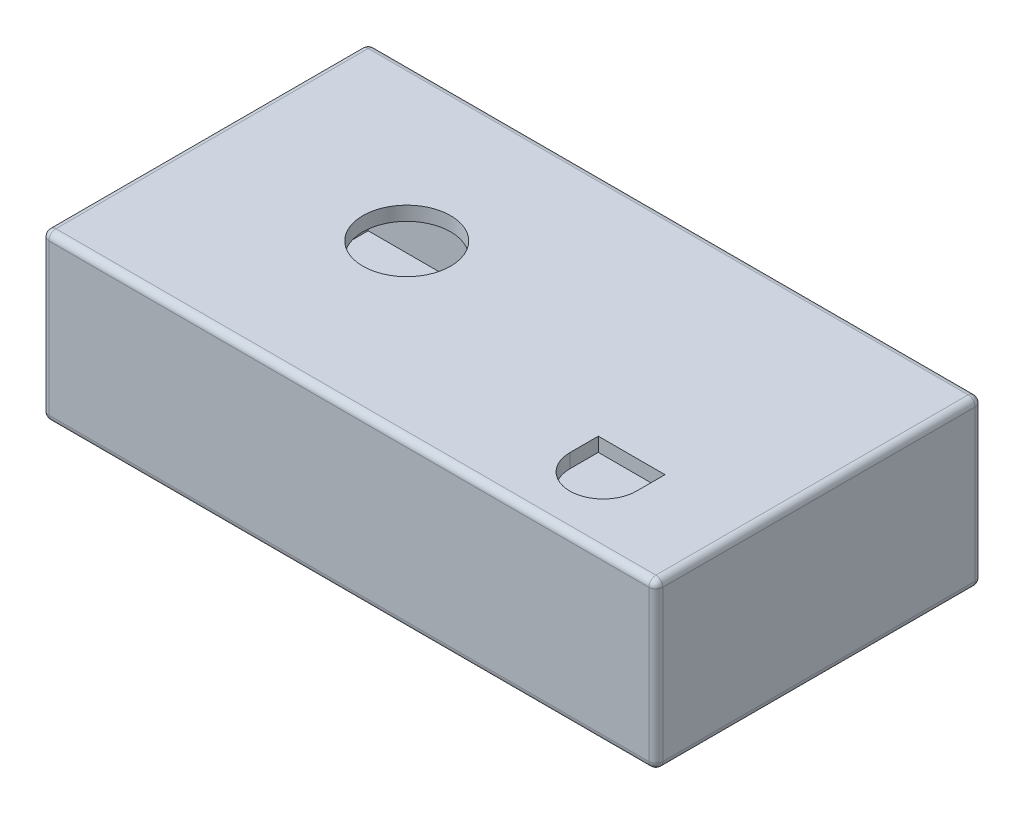
ISO-10303-21;
HEADER;
FILE_DESCRIPTION(('STEP AP214'),'2;1');
FILE_NAME('part.step','',(''),(''),'','','');
FILE_SCHEMA(('AUTOMOTIVE_DESIGN { 1 0 10303 214 1 1 1 1 }'));
ENDSEC;
DATA;
#1=APPLICATION_CONTEXT('core data for automotive mechanical design processes');
#2=APPLICATION_PROTOCOL_DEFINITION('international standard','automotive_design',2000,#1);
#3=PRODUCT_CONTEXT('',#1,'mechanical');
#4=PRODUCT('Part','Part','',(#3));
#5=PRODUCT_RELATED_PRODUCT_CATEGORY('part','',(#4));
#6=PRODUCT_DEFINITION_FORMATION('','',#4);
#7=PRODUCT_DEFINITION_CONTEXT('part definition',#1,'design');
#8=PRODUCT_DEFINITION('design','',#6,#7);
#9=PRODUCT_DEFINITION_SHAPE('','',#8);
#10=(LENGTH_UNIT() NAMED_UNIT(*) SI_UNIT(.MILLI.,.METRE.));
#11=(NAMED_UNIT(*) PLANE_ANGLE_UNIT() SI_UNIT($,.RADIAN.));
#12=(NAMED_UNIT(*) SI_UNIT($,.STERADIAN.) SOLID_ANGLE_UNIT());
#13=UNCERTAINTY_MEASURE_WITH_UNIT(LENGTH_MEASURE(1.E-05),#10,'distance_accuracy_value','');
#14=(GEOMETRIC_REPRESENTATION_CONTEXT(3) GLOBAL_UNCERTAINTY_ASSIGNED_CONTEXT((#13)) GLOBAL_UNIT_ASSIGNED_CONTEXT((#10,
#11,#12)) REPRESENTATION_CONTEXT('',''));
#15=CARTESIAN_POINT('',(0.,0.,0.));
#16=DIRECTION('',(0.,0.,1.));
#17=DIRECTION('',(1.,0.,0.));
#18=AXIS2_PLACEMENT_3D('',#15,#16,#17);
#19=CARTESIAN_POINT('',(0.,0.,118.11));
#20=DIRECTION('',(1.,0.,0.));
#21=DIRECTION('',(0.,0.,-1.));
#22=AXIS2_PLACEMENT_3D('',#19,#20,#21);
#23=PLANE('',#22);
#24=DIRECTION('',(0.,-1.,0.));
#25=VECTOR('',#24,1.);
#26=CARTESIAN_POINT('',(0.,0.,2.54));
#27=LINE('',#26,#25);
#28=CARTESIAN_POINT('',(0.,57.15,2.54));
#29=VERTEX_POINT('',#28);
#30=CARTESIAN_POINT('',(0.,2.54,2.54));
#31=VERTEX_POINT('',#30);
#32=EDGE_CURVE('E232',#29,#31,#27,.T.);
#33=ORIENTED_EDGE('',*,*,#32,.T.);
#34=DIRECTION('',(0.,0.,-1.));
#35=VECTOR('',#34,1.);
#36=CARTESIAN_POINT('',(0.,2.54,118.11));
#37=LINE('',#36,#35);
#38=CARTESIAN_POINT('',(0.,2.54,115.57));
#39=VERTEX_POINT('',#38);
#40=EDGE_CURVE('E234',#31,#39,#37,.F.);
#41=ORIENTED_EDGE('',*,*,#40,.T.);
#42=DIRECTION('',(0.,-1.,0.));
#43=VECTOR('',#42,1.);
#44=CARTESIAN_POINT('',(0.,0.,115.57));
#45=LINE('',#44,#43);
#46=CARTESIAN_POINT('',(0.,57.15,115.57));
#47=VERTEX_POINT('',#46);
#48=EDGE_CURVE('E230',#39,#47,#45,.F.);
#49=ORIENTED_EDGE('',*,*,#48,.T.);
#50=DIRECTION('',(0.,0.,-1.));
#51=VECTOR('',#50,1.);
#52=CARTESIAN_POINT('',(0.,57.15,118.11));
#53=LINE('',#52,#51);
#54=EDGE_CURVE('E228',#47,#29,#53,.T.);
#55=ORIENTED_EDGE('',*,*,#54,.T.);
#56=EDGE_LOOP('',(#33,#41,#49,#55));
#57=FACE_BOUND('',#56,.T.);
#58=ADVANCED_FACE('F32',(#57),#23,.F.);
#59=CARTESIAN_POINT('',(0.,0.,118.11));
#60=DIRECTION('',(0.,1.,0.));
#61=DIRECTION('',(0.,0.,1.));
#62=AXIS2_PLACEMENT_3D('',#59,#60,#61);
#63=PLANE('',#62);
#64=DIRECTION('',(0.,0.,-1.));
#65=VECTOR('',#64,1.);
#66=CARTESIAN_POINT('',(219.71,0.,118.11));
#67=LINE('',#66,#65);
#68=CARTESIAN_POINT('',(219.71,0.,2.54));
#69=VERTEX_POINT('',#68);
#70=CARTESIAN_POINT('',(219.71,0.,115.57));
#71=VERTEX_POINT('',#70);
#72=EDGE_CURVE('E214',#69,#71,#67,.F.);
#73=ORIENTED_EDGE('',*,*,#72,.T.);
#74=DIRECTION('',(1.,0.,0.));
#75=VECTOR('',#74,1.);
#76=CARTESIAN_POINT('',(0.,0.,115.57));
#77=LINE('',#76,#75);
#78=CARTESIAN_POINT('',(2.54,0.,115.57));
#79=VERTEX_POINT('',#78);
#80=EDGE_CURVE('E216',#71,#79,#77,.F.);
#81=ORIENTED_EDGE('',*,*,#80,.T.);
#82=DIRECTION('',(0.,0.,-1.));
#83=VECTOR('',#82,1.);
#84=CARTESIAN_POINT('',(2.54,0.,118.11));
#85=LINE('',#84,#83);
#86=CARTESIAN_POINT('',(2.54,0.,2.54));
#87=VERTEX_POINT('',#86);
#88=EDGE_CURVE('E212',#79,#87,#85,.T.);
#89=ORIENTED_EDGE('',*,*,#88,.T.);
#90=DIRECTION('',(1.,0.,0.));
#91=VECTOR('',#90,1.);
#92=CARTESIAN_POINT('',(222.25,0.,2.54));
#93=LINE('',#92,#91);
#94=EDGE_CURVE('E210',#87,#69,#93,.T.);
#95=ORIENTED_EDGE('',*,*,#94,.T.);
#96=EDGE_LOOP('',(#73,#81,#89,#95));
#97=FACE_BOUND('',#96,.T.);
#98=ADVANCED_FACE('F380',(#97),#63,.F.);
#99=CARTESIAN_POINT('',(222.25,0.,118.11));
#100=DIRECTION('',(-1.,0.,0.));
#101=DIRECTION('',(0.,0.,1.));
#102=AXIS2_PLACEMENT_3D('',#99,#100,#101);
#103=PLANE('',#102);
#104=DIRECTION('',(0.,1.,0.));
#105=VECTOR('',#104,1.);
#106=CARTESIAN_POINT('',(222.25,0.,115.57));
#107=LINE('',#106,#105);
#108=CARTESIAN_POINT('',(222.25,57.15,115.57));
#109=VERTEX_POINT('',#108);
#110=CARTESIAN_POINT('',(222.25,2.54,115.57));
#111=VERTEX_POINT('',#110);
#112=EDGE_CURVE('E221',#109,#111,#107,.F.);
#113=ORIENTED_EDGE('',*,*,#112,.T.);
#114=DIRECTION('',(0.,0.,-1.));
#115=VECTOR('',#114,1.);
#116=CARTESIAN_POINT('',(222.25,2.54,118.11));
#117=LINE('',#116,#115);
#118=CARTESIAN_POINT('',(222.25,2.54,2.54));
#119=VERTEX_POINT('',#118);
#120=EDGE_CURVE('E225',#111,#119,#117,.T.);
#121=ORIENTED_EDGE('',*,*,#120,.T.);
#122=DIRECTION('',(0.,1.,0.));
#123=VECTOR('',#122,1.);
#124=CARTESIAN_POINT('',(222.25,59.69,2.54));
#125=LINE('',#124,#123);
#126=CARTESIAN_POINT('',(222.25,57.15,2.54));
#127=VERTEX_POINT('',#126);
#128=EDGE_CURVE('E223',#119,#127,#125,.T.);
#129=ORIENTED_EDGE('',*,*,#128,.T.);
#130=DIRECTION('',(0.,0.,-1.));
#131=VECTOR('',#130,1.);
#132=CARTESIAN_POINT('',(222.25,57.15,118.11));
#133=LINE('',#132,#131);
#134=EDGE_CURVE('E219',#127,#109,#133,.F.);
#135=ORIENTED_EDGE('',*,*,#134,.T.);
#136=EDGE_LOOP('',(#113,#121,#129,#135));
#137=FACE_BOUND('',#136,.T.);
#138=ADVANCED_FACE('F386',(#137),#103,.F.);
#139=CARTESIAN_POINT('',(0.,59.69,118.11));
#140=DIRECTION('',(0.,-1.,0.));
#141=DIRECTION('',(0.,0.,-1.));
#142=AXIS2_PLACEMENT_3D('',#139,#140,#141);
#143=PLANE('',#142);
#144=CARTESIAN_POINT('',(177.8,59.69,92.71));
#145=DIRECTION('',(0.,1.,0.));
#146=DIRECTION('',(0.,0.,-1.));
#147=AXIS2_PLACEMENT_3D('',#144,#145,#146);
#148=CIRCLE('',#147,12.065);
#149=CARTESIAN_POINT('',(165.735,59.69,92.71));
#150=VERTEX_POINT('',#149);
#151=CARTESIAN_POINT('',(189.865,59.69,92.71));
#152=VERTEX_POINT('',#151);
#153=EDGE_CURVE('E180',#150,#152,#148,.T.);
#154=ORIENTED_EDGE('',*,*,#153,.F.);
#155=DIRECTION('',(0.,0.,1.));
#156=VECTOR('',#155,1.);
#157=CARTESIAN_POINT('',(165.735,59.69,92.71));
#158=LINE('',#157,#156);
#159=CARTESIAN_POINT('',(165.735,59.69,82.423));
#160=VERTEX_POINT('',#159);
#161=EDGE_CURVE('E47',#160,#150,#158,.T.);
#162=ORIENTED_EDGE('',*,*,#161,.F.);
#163=DIRECTION('',(-1.,0.,0.));
#164=VECTOR('',#163,1.);
#165=CARTESIAN_POINT('',(165.735,59.69,82.423));
#166=LINE('',#165,#164);
#167=CARTESIAN_POINT('',(189.865,59.69,82.423));
#168=VERTEX_POINT('',#167);
#169=EDGE_CURVE('E187',#168,#160,#166,.T.);
#170=ORIENTED_EDGE('',*,*,#169,.F.);
#171=DIRECTION('',(0.,0.,-1.));
#172=VECTOR('',#171,1.);
#173=CARTESIAN_POINT('',(189.865,59.69,82.423));
#174=LINE('',#173,#172);
#175=EDGE_CURVE('E171',#152,#168,#174,.T.);
#176=ORIENTED_EDGE('',*,*,#175,.F.);
#177=EDGE_LOOP('',(#154,#162,#170,#176));
#178=FACE_BOUND('',#177,.T.);
#179=CARTESIAN_POINT('',(69.85,59.69,55.88));
#180=DIRECTION('',(0.,1.,0.));
#181=DIRECTION('',(0.,0.,1.));
#182=AXIS2_PLACEMENT_3D('',#179,#180,#181);
#183=CIRCLE('',#182,15.875);
#184=CARTESIAN_POINT('',(69.85,59.69,71.755));
#185=VERTEX_POINT('',#184);
#186=EDGE_CURVE('E194',#185,#185,#183,.T.);
#187=ORIENTED_EDGE('',*,*,#186,.F.);
#188=EDGE_LOOP('',(#187));
#189=FACE_BOUND('',#188,.T.);
#190=DIRECTION('',(0.,0.,-1.));
#191=VECTOR('',#190,1.);
#192=CARTESIAN_POINT('',(2.54,59.69,118.11));
#193=LINE('',#192,#191);
#194=CARTESIAN_POINT('',(2.54,59.69,2.54));
#195=VERTEX_POINT('',#194);
#196=CARTESIAN_POINT('',(2.54,59.69,115.57));
#197=VERTEX_POINT('',#196);
#198=EDGE_CURVE('E246',#195,#197,#193,.F.);
#199=ORIENTED_EDGE('',*,*,#198,.T.);
#200=DIRECTION('',(-1.,0.,0.));
#201=VECTOR('',#200,1.);
#202=CARTESIAN_POINT('',(0.,59.69,115.57));
#203=LINE('',#202,#201);
#204=CARTESIAN_POINT('',(219.71,59.69,115.57));
#205=VERTEX_POINT('',#204);
#206=EDGE_CURVE('E252',#197,#205,#203,.F.);
#207=ORIENTED_EDGE('',*,*,#206,.T.);
#208=DIRECTION('',(0.,0.,-1.));
#209=VECTOR('',#208,1.);
#210=CARTESIAN_POINT('',(219.71,59.69,118.11));
#211=LINE('',#210,#209);
#212=CARTESIAN_POINT('',(219.71,59.69,2.54));
#213=VERTEX_POINT('',#212);
#214=EDGE_CURVE('E250',#205,#213,#211,.T.);
#215=ORIENTED_EDGE('',*,*,#214,.T.);
#216=DIRECTION('',(-1.,0.,0.));
#217=VECTOR('',#216,1.);
#218=CARTESIAN_POINT('',(0.,59.69,2.54));
#219=LINE('',#218,#217);
#220=EDGE_CURVE('E248',#213,#195,#219,.T.);
#221=ORIENTED_EDGE('',*,*,#220,.T.);
#222=EDGE_LOOP('',(#199,#207,#215,#221));
#223=FACE_BOUND('',#222,.T.);
#224=ADVANCED_FACE('F184',(#178,#189,#223),#143,.F.);
#225=CARTESIAN_POINT('',(0.,0.,118.11));
#226=DIRECTION('',(0.,0.,-1.));
#227=DIRECTION('',(-1.,0.,0.));
#228=AXIS2_PLACEMENT_3D('',#225,#226,#227);
#229=PLANE('',#228);
#230=DIRECTION('',(0.,-1.,0.));
#231=VECTOR('',#230,1.);
#232=CARTESIAN_POINT('',(2.54,0.,118.11));
#233=LINE('',#232,#231);
#234=CARTESIAN_POINT('',(2.54,57.15,118.11));
#235=VERTEX_POINT('',#234);
#236=CARTESIAN_POINT('',(2.54,2.54,118.11));
#237=VERTEX_POINT('',#236);
#238=EDGE_CURVE('E202',#235,#237,#233,.T.);
#239=ORIENTED_EDGE('',*,*,#238,.T.);
#240=DIRECTION('',(1.,0.,0.));
#241=VECTOR('',#240,1.);
#242=CARTESIAN_POINT('',(0.,2.54,118.11));
#243=LINE('',#242,#241);
#244=CARTESIAN_POINT('',(219.71,2.54,118.11));
#245=VERTEX_POINT('',#244);
#246=EDGE_CURVE('E207',#237,#245,#243,.T.);
#247=ORIENTED_EDGE('',*,*,#246,.T.);
#248=DIRECTION('',(0.,1.,0.));
#249=VECTOR('',#248,1.);
#250=CARTESIAN_POINT('',(219.71,0.,118.11));
#251=LINE('',#250,#249);
#252=CARTESIAN_POINT('',(219.71,57.15,118.11));
#253=VERTEX_POINT('',#252);
#254=EDGE_CURVE('E205',#245,#253,#251,.T.);
#255=ORIENTED_EDGE('',*,*,#254,.T.);
#256=DIRECTION('',(-1.,0.,0.));
#257=VECTOR('',#256,1.);
#258=CARTESIAN_POINT('',(0.,57.15,118.11));
#259=LINE('',#258,#257);
#260=EDGE_CURVE('E200',#253,#235,#259,.T.);
#261=ORIENTED_EDGE('',*,*,#260,.T.);
#262=EDGE_LOOP('',(#239,#247,#255,#261));
#263=FACE_BOUND('',#262,.T.);
#264=ADVANCED_FACE('F513',(#263),#229,.F.);
#265=CARTESIAN_POINT('',(0.,0.,0.));
#266=DIRECTION('',(0.,0.,-1.));
#267=DIRECTION('',(-1.,0.,0.));
#268=AXIS2_PLACEMENT_3D('',#265,#266,#267);
#269=PLANE('',#268);
#270=DIRECTION('',(0.,1.,0.));
#271=VECTOR('',#270,1.);
#272=CARTESIAN_POINT('',(219.71,0.,0.));
#273=LINE('',#272,#271);
#274=CARTESIAN_POINT('',(219.71,57.15,0.));
#275=VERTEX_POINT('',#274);
#276=CARTESIAN_POINT('',(219.71,2.54,0.));
#277=VERTEX_POINT('',#276);
#278=EDGE_CURVE('E239',#275,#277,#273,.F.);
#279=ORIENTED_EDGE('',*,*,#278,.T.);
#280=DIRECTION('',(1.,0.,0.));
#281=VECTOR('',#280,1.);
#282=CARTESIAN_POINT('',(0.,2.54,0.));
#283=LINE('',#282,#281);
#284=CARTESIAN_POINT('',(2.54,2.54,0.));
#285=VERTEX_POINT('',#284);
#286=EDGE_CURVE('E243',#277,#285,#283,.F.);
#287=ORIENTED_EDGE('',*,*,#286,.T.);
#288=DIRECTION('',(0.,-1.,0.));
#289=VECTOR('',#288,1.);
#290=CARTESIAN_POINT('',(2.54,59.69,0.));
#291=LINE('',#290,#289);
#292=CARTESIAN_POINT('',(2.54,57.15,0.));
#293=VERTEX_POINT('',#292);
#294=EDGE_CURVE('E241',#285,#293,#291,.F.);
#295=ORIENTED_EDGE('',*,*,#294,.T.);
#296=DIRECTION('',(-1.,0.,0.));
#297=VECTOR('',#296,1.);
#298=CARTESIAN_POINT('',(222.25,57.15,0.));
#299=LINE('',#298,#297);
#300=EDGE_CURVE('E237',#293,#275,#299,.F.);
#301=ORIENTED_EDGE('',*,*,#300,.T.);
#302=EDGE_LOOP('',(#279,#287,#295,#301));
#303=FACE_BOUND('',#302,.T.);
#304=ADVANCED_FACE('F471',(#303),#269,.T.);
#305=CARTESIAN_POINT('',(0.,57.15,2.54));
#306=DIRECTION('',(1.,0.,0.));
#307=DIRECTION('',(0.,0.,-1.));
#308=AXIS2_PLACEMENT_3D('',#305,#306,#307);
#309=CYLINDRICAL_SURFACE('',#308,2.54);
#310=CARTESIAN_POINT('',(2.54,57.15,2.54));
#311=DIRECTION('',(-1.,0.,0.));
#312=DIRECTION('',(0.,0.,1.));
#313=AXIS2_PLACEMENT_3D('',#310,#311,#312);
#314=CIRCLE('',#313,2.54);
#315=EDGE_CURVE('E203',#195,#293,#314,.T.);
#316=ORIENTED_EDGE('',*,*,#315,.F.);
#317=ORIENTED_EDGE('',*,*,#220,.F.);
#318=CARTESIAN_POINT('',(219.71,57.15,2.54));
#319=DIRECTION('',(1.,0.,0.));
#320=DIRECTION('',(0.,0.,-1.));
#321=AXIS2_PLACEMENT_3D('',#318,#319,#320);
#322=CIRCLE('',#321,2.54);
#323=EDGE_CURVE('E316',#275,#213,#322,.T.);
#324=ORIENTED_EDGE('',*,*,#323,.F.);
#325=ORIENTED_EDGE('',*,*,#300,.F.);
#326=EDGE_LOOP('',(#316,#317,#324,#325));
#327=FACE_BOUND('',#326,.T.);
#328=ADVANCED_FACE('F467',(#327),#309,.T.);
#329=CARTESIAN_POINT('',(2.54,57.15,2.54));
#330=DIRECTION('',(0.,0.,1.));
#331=DIRECTION('',(1.,0.,0.));
#332=AXIS2_PLACEMENT_3D('',#329,#330,#331);
#333=SPHERICAL_SURFACE('',#332,2.54);
#334=CARTESIAN_POINT('',(2.54,57.15,2.54));
#335=DIRECTION('',(0.,0.,-1.));
#336=DIRECTION('',(-1.,0.,0.));
#337=AXIS2_PLACEMENT_3D('',#334,#335,#336);
#338=CIRCLE('',#337,2.54);
#339=EDGE_CURVE('E310',#195,#29,#338,.F.);
#340=ORIENTED_EDGE('',*,*,#339,.F.);
#341=ORIENTED_EDGE('',*,*,#315,.T.);
#342=CARTESIAN_POINT('',(2.54,57.15,2.54));
#343=DIRECTION('',(0.,1.,0.));
#344=DIRECTION('',(0.,0.,1.));
#345=AXIS2_PLACEMENT_3D('',#342,#343,#344);
#346=CIRCLE('',#345,2.54);
#347=EDGE_CURVE('E313',#29,#293,#346,.F.);
#348=ORIENTED_EDGE('',*,*,#347,.F.);
#349=EDGE_LOOP('',(#340,#341,#348));
#350=FACE_BOUND('',#349,.T.);
#351=ADVANCED_FACE('F463',(#350),#333,.T.);
#352=CARTESIAN_POINT('',(219.71,57.15,2.54));
#353=DIRECTION('',(0.,0.,1.));
#354=DIRECTION('',(1.,0.,0.));
#355=AXIS2_PLACEMENT_3D('',#352,#353,#354);
#356=SPHERICAL_SURFACE('',#355,2.54);
#357=CARTESIAN_POINT('',(219.71,57.15,2.54));
#358=DIRECTION('',(0.,1.,0.));
#359=DIRECTION('',(0.,0.,1.));
#360=AXIS2_PLACEMENT_3D('',#357,#358,#359);
#361=CIRCLE('',#360,2.54);
#362=EDGE_CURVE('E304',#275,#127,#361,.F.);
#363=ORIENTED_EDGE('',*,*,#362,.F.);
#364=ORIENTED_EDGE('',*,*,#323,.T.);
#365=CARTESIAN_POINT('',(219.71,57.15,2.54));
#366=DIRECTION('',(0.,0.,-1.));
#367=DIRECTION('',(-1.,0.,0.));
#368=AXIS2_PLACEMENT_3D('',#365,#366,#367);
#369=CIRCLE('',#368,2.54);
#370=EDGE_CURVE('E307',#127,#213,#369,.F.);
#371=ORIENTED_EDGE('',*,*,#370,.F.);
#372=EDGE_LOOP('',(#363,#364,#371));
#373=FACE_BOUND('',#372,.T.);
#374=ADVANCED_FACE('F459',(#373),#356,.T.);
#375=CARTESIAN_POINT('',(2.54,0.,2.54));
#376=DIRECTION('',(0.,1.,0.));
#377=DIRECTION('',(0.,0.,1.));
#378=AXIS2_PLACEMENT_3D('',#375,#376,#377);
#379=CYLINDRICAL_SURFACE('',#378,2.54);
#380=ORIENTED_EDGE('',*,*,#347,.T.);
#381=ORIENTED_EDGE('',*,*,#294,.F.);
#382=CARTESIAN_POINT('',(2.54,2.54,2.54));
#383=DIRECTION('',(0.,-1.,0.));
#384=DIRECTION('',(0.,0.,-1.));
#385=AXIS2_PLACEMENT_3D('',#382,#383,#384);
#386=CIRCLE('',#385,2.54);
#387=EDGE_CURVE('E299',#31,#285,#386,.T.);
#388=ORIENTED_EDGE('',*,*,#387,.F.);
#389=ORIENTED_EDGE('',*,*,#32,.F.);
#390=EDGE_LOOP('',(#380,#381,#388,#389));
#391=FACE_BOUND('',#390,.T.);
#392=ADVANCED_FACE('F455',(#391),#379,.T.);
#393=CARTESIAN_POINT('',(2.54,57.15,118.11));
#394=DIRECTION('',(0.,0.,-1.));
#395=DIRECTION('',(-1.,0.,0.));
#396=AXIS2_PLACEMENT_3D('',#393,#394,#395);
#397=CYLINDRICAL_SURFACE('',#396,2.54);
#398=ORIENTED_EDGE('',*,*,#339,.T.);
#399=ORIENTED_EDGE('',*,*,#54,.F.);
#400=CARTESIAN_POINT('',(2.54,57.15,115.57));
#401=DIRECTION('',(0.,0.,1.));
#402=DIRECTION('',(1.,0.,0.));
#403=AXIS2_PLACEMENT_3D('',#400,#401,#402);
#404=CIRCLE('',#403,2.54);
#405=EDGE_CURVE('E296',#197,#47,#404,.T.);
#406=ORIENTED_EDGE('',*,*,#405,.F.);
#407=ORIENTED_EDGE('',*,*,#198,.F.);
#408=EDGE_LOOP('',(#398,#399,#406,#407));
#409=FACE_BOUND('',#408,.T.);
#410=ADVANCED_FACE('F451',(#409),#397,.T.);
#411=CARTESIAN_POINT('',(0.,57.15,115.57));
#412=DIRECTION('',(-1.,0.,0.));
#413=DIRECTION('',(0.,0.,1.));
#414=AXIS2_PLACEMENT_3D('',#411,#412,#413);
#415=CYLINDRICAL_SURFACE('',#414,2.54);
#416=CARTESIAN_POINT('',(219.71,57.15,115.57));
#417=DIRECTION('',(1.,0.,0.));
#418=DIRECTION('',(0.,0.,-1.));
#419=AXIS2_PLACEMENT_3D('',#416,#417,#418);
#420=CIRCLE('',#419,2.54);
#421=EDGE_CURVE('E290',#205,#253,#420,.T.);
#422=ORIENTED_EDGE('',*,*,#421,.F.);
#423=ORIENTED_EDGE('',*,*,#206,.F.);
#424=CARTESIAN_POINT('',(2.54,57.15,115.57));
#425=DIRECTION('',(-1.,0.,0.));
#426=DIRECTION('',(0.,0.,1.));
#427=AXIS2_PLACEMENT_3D('',#424,#425,#426);
#428=CIRCLE('',#427,2.54);
#429=EDGE_CURVE('E293',#235,#197,#428,.T.);
#430=ORIENTED_EDGE('',*,*,#429,.F.);
#431=ORIENTED_EDGE('',*,*,#260,.F.);
#432=EDGE_LOOP('',(#422,#423,#430,#431));
#433=FACE_BOUND('',#432,.T.);
#434=ADVANCED_FACE('F447',(#433),#415,.T.);
#435=CARTESIAN_POINT('',(219.71,57.15,118.11));
#436=DIRECTION('',(0.,0.,-1.));
#437=DIRECTION('',(-1.,0.,0.));
#438=AXIS2_PLACEMENT_3D('',#435,#436,#437);
#439=CYLINDRICAL_SURFACE('',#438,2.54);
#440=ORIENTED_EDGE('',*,*,#370,.T.);
#441=ORIENTED_EDGE('',*,*,#214,.F.);
#442=CARTESIAN_POINT('',(219.71,57.15,115.57));
#443=DIRECTION('',(0.,0.,1.));
#444=DIRECTION('',(1.,0.,0.));
#445=AXIS2_PLACEMENT_3D('',#442,#443,#444);
#446=CIRCLE('',#445,2.54);
#447=EDGE_CURVE('E288',#109,#205,#446,.T.);
#448=ORIENTED_EDGE('',*,*,#447,.F.);
#449=ORIENTED_EDGE('',*,*,#134,.F.);
#450=EDGE_LOOP('',(#440,#441,#448,#449));
#451=FACE_BOUND('',#450,.T.);
#452=ADVANCED_FACE('F443',(#451),#439,.T.);
#453=CARTESIAN_POINT('',(219.71,0.,2.54));
#454=DIRECTION('',(0.,-1.,0.));
#455=DIRECTION('',(0.,0.,-1.));
#456=AXIS2_PLACEMENT_3D('',#453,#454,#455);
#457=CYLINDRICAL_SURFACE('',#456,2.54);
#458=ORIENTED_EDGE('',*,*,#362,.T.);
#459=ORIENTED_EDGE('',*,*,#128,.F.);
#460=CARTESIAN_POINT('',(219.71,2.54,2.54));
#461=DIRECTION('',(0.,-1.,0.));
#462=DIRECTION('',(0.,0.,-1.));
#463=AXIS2_PLACEMENT_3D('',#460,#461,#462);
#464=CIRCLE('',#463,2.54);
#465=EDGE_CURVE('E285',#277,#119,#464,.T.);
#466=ORIENTED_EDGE('',*,*,#465,.F.);
#467=ORIENTED_EDGE('',*,*,#278,.F.);
#468=EDGE_LOOP('',(#458,#459,#466,#467));
#469=FACE_BOUND('',#468,.T.);
#470=ADVANCED_FACE('F439',(#469),#457,.T.);
#471=CARTESIAN_POINT('',(0.,2.54,2.54));
#472=DIRECTION('',(-1.,0.,0.));
#473=DIRECTION('',(0.,0.,1.));
#474=AXIS2_PLACEMENT_3D('',#471,#472,#473);
#475=CYLINDRICAL_SURFACE('',#474,2.54);
#476=CARTESIAN_POINT('',(2.54,2.54,2.54));
#477=DIRECTION('',(-1.,0.,0.));
#478=DIRECTION('',(0.,0.,1.));
#479=AXIS2_PLACEMENT_3D('',#476,#477,#478);
#480=CIRCLE('',#479,2.54);
#481=EDGE_CURVE('E301',#285,#87,#480,.T.);
#482=ORIENTED_EDGE('',*,*,#481,.F.);
#483=ORIENTED_EDGE('',*,*,#286,.F.);
#484=CARTESIAN_POINT('',(219.71,2.54,2.54));
#485=DIRECTION('',(1.,0.,0.));
#486=DIRECTION('',(0.,0.,-1.));
#487=AXIS2_PLACEMENT_3D('',#484,#485,#486);
#488=CIRCLE('',#487,2.54);
#489=EDGE_CURVE('E282',#69,#277,#488,.T.);
#490=ORIENTED_EDGE('',*,*,#489,.F.);
#491=ORIENTED_EDGE('',*,*,#94,.F.);
#492=EDGE_LOOP('',(#482,#483,#490,#491));
#493=FACE_BOUND('',#492,.T.);
#494=ADVANCED_FACE('F435',(#493),#475,.T.);
#495=CARTESIAN_POINT('',(2.54,2.54,2.54));
#496=DIRECTION('',(0.,0.,1.));
#497=DIRECTION('',(1.,0.,0.));
#498=AXIS2_PLACEMENT_3D('',#495,#496,#497);
#499=SPHERICAL_SURFACE('',#498,2.54);
#500=ORIENTED_EDGE('',*,*,#387,.T.);
#501=ORIENTED_EDGE('',*,*,#481,.T.);
#502=CARTESIAN_POINT('',(2.54,2.54,2.54));
#503=DIRECTION('',(0.,0.,-1.));
#504=DIRECTION('',(-1.,0.,0.));
#505=AXIS2_PLACEMENT_3D('',#502,#503,#504);
#506=CIRCLE('',#505,2.54);
#507=EDGE_CURVE('E279',#31,#87,#506,.F.);
#508=ORIENTED_EDGE('',*,*,#507,.F.);
#509=EDGE_LOOP('',(#500,#501,#508));
#510=FACE_BOUND('',#509,.T.);
#511=ADVANCED_FACE('F431',(#510),#499,.T.);
#512=CARTESIAN_POINT('',(2.54,57.15,115.57));
#513=DIRECTION('',(0.,0.,1.));
#514=DIRECTION('',(1.,0.,0.));
#515=AXIS2_PLACEMENT_3D('',#512,#513,#514);
#516=SPHERICAL_SURFACE('',#515,2.54);
#517=ORIENTED_EDGE('',*,*,#429,.T.);
#518=ORIENTED_EDGE('',*,*,#405,.T.);
#519=CARTESIAN_POINT('',(2.54,57.15,115.57));
#520=DIRECTION('',(0.,1.,0.));
#521=DIRECTION('',(0.,0.,1.));
#522=AXIS2_PLACEMENT_3D('',#519,#520,#521);
#523=CIRCLE('',#522,2.54);
#524=EDGE_CURVE('E276',#235,#47,#523,.F.);
#525=ORIENTED_EDGE('',*,*,#524,.F.);
#526=EDGE_LOOP('',(#517,#518,#525));
#527=FACE_BOUND('',#526,.T.);
#528=ADVANCED_FACE('F427',(#527),#516,.T.);
#529=CARTESIAN_POINT('',(219.71,57.15,115.57));
#530=DIRECTION('',(0.,0.,1.));
#531=DIRECTION('',(1.,0.,0.));
#532=AXIS2_PLACEMENT_3D('',#529,#530,#531);
#533=SPHERICAL_SURFACE('',#532,2.54);
#534=ORIENTED_EDGE('',*,*,#447,.T.);
#535=ORIENTED_EDGE('',*,*,#421,.T.);
#536=CARTESIAN_POINT('',(219.71,57.15,115.57));
#537=DIRECTION('',(0.,1.,0.));
#538=DIRECTION('',(0.,0.,1.));
#539=AXIS2_PLACEMENT_3D('',#536,#537,#538);
#540=CIRCLE('',#539,2.54);
#541=EDGE_CURVE('E273',#109,#253,#540,.F.);
#542=ORIENTED_EDGE('',*,*,#541,.F.);
#543=EDGE_LOOP('',(#534,#535,#542));
#544=FACE_BOUND('',#543,.T.);
#545=ADVANCED_FACE('F423',(#544),#533,.T.);
#546=CARTESIAN_POINT('',(219.71,2.54,2.54));
#547=DIRECTION('',(0.,0.,1.));
#548=DIRECTION('',(1.,0.,0.));
#549=AXIS2_PLACEMENT_3D('',#546,#547,#548);
#550=SPHERICAL_SURFACE('',#549,2.54);
#551=ORIENTED_EDGE('',*,*,#489,.T.);
#552=ORIENTED_EDGE('',*,*,#465,.T.);
#553=CARTESIAN_POINT('',(219.71,2.54,2.54));
#554=DIRECTION('',(0.,0.,-1.));
#555=DIRECTION('',(-1.,0.,0.));
#556=AXIS2_PLACEMENT_3D('',#553,#554,#555);
#557=CIRCLE('',#556,2.54);
#558=EDGE_CURVE('E271',#69,#119,#557,.F.);
#559=ORIENTED_EDGE('',*,*,#558,.F.);
#560=EDGE_LOOP('',(#551,#552,#559));
#561=FACE_BOUND('',#560,.T.);
#562=ADVANCED_FACE('F419',(#561),#550,.T.);
#563=CARTESIAN_POINT('',(2.54,2.54,118.11));
#564=DIRECTION('',(0.,0.,-1.));
#565=DIRECTION('',(-1.,0.,0.));
#566=AXIS2_PLACEMENT_3D('',#563,#564,#565);
#567=CYLINDRICAL_SURFACE('',#566,2.54);
#568=ORIENTED_EDGE('',*,*,#507,.T.);
#569=ORIENTED_EDGE('',*,*,#88,.F.);
#570=CARTESIAN_POINT('',(2.54,2.54,115.57));
#571=DIRECTION('',(0.,0.,1.));
#572=DIRECTION('',(1.,0.,0.));
#573=AXIS2_PLACEMENT_3D('',#570,#571,#572);
#574=CIRCLE('',#573,2.54);
#575=EDGE_CURVE('E268',#39,#79,#574,.T.);
#576=ORIENTED_EDGE('',*,*,#575,.F.);
#577=ORIENTED_EDGE('',*,*,#40,.F.);
#578=EDGE_LOOP('',(#568,#569,#576,#577));
#579=FACE_BOUND('',#578,.T.);
#580=ADVANCED_FACE('F415',(#579),#567,.T.);
#581=CARTESIAN_POINT('',(2.54,0.,115.57));
#582=DIRECTION('',(0.,-1.,0.));
#583=DIRECTION('',(0.,0.,-1.));
#584=AXIS2_PLACEMENT_3D('',#581,#582,#583);
#585=CYLINDRICAL_SURFACE('',#584,2.54);
#586=ORIENTED_EDGE('',*,*,#524,.T.);
#587=ORIENTED_EDGE('',*,*,#48,.F.);
#588=CARTESIAN_POINT('',(2.54,2.54,115.57));
#589=DIRECTION('',(0.,-1.,0.));
#590=DIRECTION('',(0.,0.,-1.));
#591=AXIS2_PLACEMENT_3D('',#588,#589,#590);
#592=CIRCLE('',#591,2.54);
#593=EDGE_CURVE('E266',#237,#39,#592,.T.);
#594=ORIENTED_EDGE('',*,*,#593,.F.);
#595=ORIENTED_EDGE('',*,*,#238,.F.);
#596=EDGE_LOOP('',(#586,#587,#594,#595));
#597=FACE_BOUND('',#596,.T.);
#598=ADVANCED_FACE('F411',(#597),#585,.T.);
#599=CARTESIAN_POINT('',(219.71,0.,115.57));
#600=DIRECTION('',(0.,1.,0.));
#601=DIRECTION('',(0.,0.,1.));
#602=AXIS2_PLACEMENT_3D('',#599,#600,#601);
#603=CYLINDRICAL_SURFACE('',#602,2.54);
#604=ORIENTED_EDGE('',*,*,#541,.T.);
#605=ORIENTED_EDGE('',*,*,#254,.F.);
#606=CARTESIAN_POINT('',(219.71,2.54,115.57));
#607=DIRECTION('',(0.,-1.,0.));
#608=DIRECTION('',(0.,0.,-1.));
#609=AXIS2_PLACEMENT_3D('',#606,#607,#608);
#610=CIRCLE('',#609,2.54);
#611=EDGE_CURVE('E263',#111,#245,#610,.T.);
#612=ORIENTED_EDGE('',*,*,#611,.F.);
#613=ORIENTED_EDGE('',*,*,#112,.F.);
#614=EDGE_LOOP('',(#604,#605,#612,#613));
#615=FACE_BOUND('',#614,.T.);
#616=ADVANCED_FACE('F407',(#615),#603,.T.);
#617=CARTESIAN_POINT('',(219.71,2.54,118.11));
#618=DIRECTION('',(0.,0.,-1.));
#619=DIRECTION('',(-1.,0.,0.));
#620=AXIS2_PLACEMENT_3D('',#617,#618,#619);
#621=CYLINDRICAL_SURFACE('',#620,2.54);
#622=ORIENTED_EDGE('',*,*,#558,.T.);
#623=ORIENTED_EDGE('',*,*,#120,.F.);
#624=CARTESIAN_POINT('',(219.71,2.54,115.57));
#625=DIRECTION('',(0.,0.,1.));
#626=DIRECTION('',(1.,0.,0.));
#627=AXIS2_PLACEMENT_3D('',#624,#625,#626);
#628=CIRCLE('',#627,2.54);
#629=EDGE_CURVE('E260',#71,#111,#628,.T.);
#630=ORIENTED_EDGE('',*,*,#629,.F.);
#631=ORIENTED_EDGE('',*,*,#72,.F.);
#632=EDGE_LOOP('',(#622,#623,#630,#631));
#633=FACE_BOUND('',#632,.T.);
#634=ADVANCED_FACE('F403',(#633),#621,.T.);
#635=CARTESIAN_POINT('',(2.54,2.54,115.57));
#636=DIRECTION('',(0.,0.,1.));
#637=DIRECTION('',(1.,0.,0.));
#638=AXIS2_PLACEMENT_3D('',#635,#636,#637);
#639=SPHERICAL_SURFACE('',#638,2.54);
#640=ORIENTED_EDGE('',*,*,#593,.T.);
#641=ORIENTED_EDGE('',*,*,#575,.T.);
#642=CARTESIAN_POINT('',(2.54,2.54,115.57));
#643=DIRECTION('',(-1.,0.,0.));
#644=DIRECTION('',(0.,0.,1.));
#645=AXIS2_PLACEMENT_3D('',#642,#643,#644);
#646=CIRCLE('',#645,2.54);
#647=EDGE_CURVE('E258',#237,#79,#646,.F.);
#648=ORIENTED_EDGE('',*,*,#647,.F.);
#649=EDGE_LOOP('',(#640,#641,#648));
#650=FACE_BOUND('',#649,.T.);
#651=ADVANCED_FACE('F399',(#650),#639,.T.);
#652=CARTESIAN_POINT('',(219.71,2.54,115.57));
#653=DIRECTION('',(0.,0.,1.));
#654=DIRECTION('',(1.,0.,0.));
#655=AXIS2_PLACEMENT_3D('',#652,#653,#654);
#656=SPHERICAL_SURFACE('',#655,2.54);
#657=ORIENTED_EDGE('',*,*,#629,.T.);
#658=ORIENTED_EDGE('',*,*,#611,.T.);
#659=CARTESIAN_POINT('',(219.71,2.54,115.57));
#660=DIRECTION('',(1.,0.,0.));
#661=DIRECTION('',(0.,0.,-1.));
#662=AXIS2_PLACEMENT_3D('',#659,#660,#661);
#663=CIRCLE('',#662,2.54);
#664=EDGE_CURVE('E256',#71,#245,#663,.F.);
#665=ORIENTED_EDGE('',*,*,#664,.F.);
#666=EDGE_LOOP('',(#657,#658,#665));
#667=FACE_BOUND('',#666,.T.);
#668=ADVANCED_FACE('F395',(#667),#656,.T.);
#669=CARTESIAN_POINT('',(0.,2.54,115.57));
#670=DIRECTION('',(1.,0.,0.));
#671=DIRECTION('',(0.,0.,-1.));
#672=AXIS2_PLACEMENT_3D('',#669,#670,#671);
#673=CYLINDRICAL_SURFACE('',#672,2.54);
#674=ORIENTED_EDGE('',*,*,#647,.T.);
#675=ORIENTED_EDGE('',*,*,#80,.F.);
#676=ORIENTED_EDGE('',*,*,#664,.T.);
#677=ORIENTED_EDGE('',*,*,#246,.F.);
#678=EDGE_LOOP('',(#674,#675,#676,#677));
#679=FACE_BOUND('',#678,.T.);
#680=ADVANCED_FACE('F391',(#679),#673,.T.);
#681=CARTESIAN_POINT('',(69.85,52.07,55.88));
#682=DIRECTION('',(0.,1.,0.));
#683=DIRECTION('',(0.,0.,1.));
#684=AXIS2_PLACEMENT_3D('',#681,#682,#683);
#685=CYLINDRICAL_SURFACE('',#684,15.875);
#686=CARTESIAN_POINT('',(69.85,54.61,55.88));
#687=DIRECTION('',(0.,-1.,0.));
#688=DIRECTION('',(0.,0.,-1.));
#689=AXIS2_PLACEMENT_3D('',#686,#687,#688);
#690=CIRCLE('',#689,15.875);
#691=CARTESIAN_POINT('',(69.85,54.61,40.005));
#692=VERTEX_POINT('',#691);
#693=EDGE_CURVE('E199',#692,#692,#690,.T.);
#694=ORIENTED_EDGE('',*,*,#693,.T.);
#695=EDGE_LOOP('',(#694));
#696=FACE_BOUND('',#695,.T.);
#697=ORIENTED_EDGE('',*,*,#186,.T.);
#698=EDGE_LOOP('',(#697));
#699=FACE_BOUND('',#698,.T.);
#700=ADVANCED_FACE('F394',(#696,#699),#685,.F.);
#701=CARTESIAN_POINT('',(5.08,0.,118.11));
#702=DIRECTION('',(1.,0.,0.));
#703=DIRECTION('',(0.,0.,-1.));
#704=AXIS2_PLACEMENT_3D('',#701,#702,#703);
#705=PLANE('',#704);
#706=DIRECTION('',(0.,1.,0.));
#707=VECTOR('',#706,1.);
#708=CARTESIAN_POINT('',(5.08,0.,5.08));
#709=LINE('',#708,#707);
#710=CARTESIAN_POINT('',(5.08,5.08,5.08));
#711=VERTEX_POINT('',#710);
#712=CARTESIAN_POINT('',(5.08,54.61,5.08));
#713=VERTEX_POINT('',#712);
#714=EDGE_CURVE('E321',#711,#713,#709,.T.);
#715=ORIENTED_EDGE('',*,*,#714,.T.);
#716=DIRECTION('',(0.,0.,-1.));
#717=VECTOR('',#716,1.);
#718=CARTESIAN_POINT('',(5.08,54.61,118.11));
#719=LINE('',#718,#717);
#720=CARTESIAN_POINT('',(5.08,54.61,113.03));
#721=VERTEX_POINT('',#720);
#722=EDGE_CURVE('E351',#721,#713,#719,.T.);
#723=ORIENTED_EDGE('',*,*,#722,.F.);
#724=DIRECTION('',(0.,1.,0.));
#725=VECTOR('',#724,1.);
#726=CARTESIAN_POINT('',(5.08,0.,113.03));
#727=LINE('',#726,#725);
#728=CARTESIAN_POINT('',(5.08,5.08,113.03));
#729=VERTEX_POINT('',#728);
#730=EDGE_CURVE('E255',#729,#721,#727,.T.);
#731=ORIENTED_EDGE('',*,*,#730,.F.);
#732=DIRECTION('',(0.,0.,-1.));
#733=VECTOR('',#732,1.);
#734=CARTESIAN_POINT('',(5.08,5.08,118.11));
#735=LINE('',#734,#733);
#736=EDGE_CURVE('E345',#729,#711,#735,.T.);
#737=ORIENTED_EDGE('',*,*,#736,.T.);
#738=EDGE_LOOP('',(#715,#723,#731,#737));
#739=FACE_BOUND('',#738,.T.);
#740=ADVANCED_FACE('F473',(#739),#705,.T.);
#741=CARTESIAN_POINT('',(0.,5.08,118.11));
#742=DIRECTION('',(0.,1.,0.));
#743=DIRECTION('',(0.,0.,1.));
#744=AXIS2_PLACEMENT_3D('',#741,#742,#743);
#745=PLANE('',#744);
#746=DIRECTION('',(0.,0.,-1.));
#747=VECTOR('',#746,1.);
#748=CARTESIAN_POINT('',(217.17,5.08,118.11));
#749=LINE('',#748,#747);
#750=CARTESIAN_POINT('',(217.17,5.08,113.03));
#751=VERTEX_POINT('',#750);
#752=CARTESIAN_POINT('',(217.17,5.08,5.08));
#753=VERTEX_POINT('',#752);
#754=EDGE_CURVE('E342',#751,#753,#749,.T.);
#755=ORIENTED_EDGE('',*,*,#754,.T.);
#756=DIRECTION('',(-1.,0.,0.));
#757=VECTOR('',#756,1.);
#758=CARTESIAN_POINT('',(0.,5.08,5.08));
#759=LINE('',#758,#757);
#760=EDGE_CURVE('E325',#753,#711,#759,.T.);
#761=ORIENTED_EDGE('',*,*,#760,.T.);
#762=ORIENTED_EDGE('',*,*,#736,.F.);
#763=DIRECTION('',(-1.,0.,0.));
#764=VECTOR('',#763,1.);
#765=CARTESIAN_POINT('',(0.,5.08,113.03));
#766=LINE('',#765,#764);
#767=EDGE_CURVE('E348',#751,#729,#766,.T.);
#768=ORIENTED_EDGE('',*,*,#767,.F.);
#769=EDGE_LOOP('',(#755,#761,#762,#768));
#770=FACE_BOUND('',#769,.T.);
#771=ADVANCED_FACE('F476',(#770),#745,.T.);
#772=CARTESIAN_POINT('',(217.17,0.,118.11));
#773=DIRECTION('',(-1.,0.,0.));
#774=DIRECTION('',(0.,0.,1.));
#775=AXIS2_PLACEMENT_3D('',#772,#773,#774);
#776=PLANE('',#775);
#777=DIRECTION('',(0.,1.,0.));
#778=VECTOR('',#777,1.);
#779=CARTESIAN_POINT('',(217.17,0.,113.03));
#780=LINE('',#779,#778);
#781=CARTESIAN_POINT('',(217.17,54.61,113.03));
#782=VERTEX_POINT('',#781);
#783=EDGE_CURVE('E328',#751,#782,#780,.T.);
#784=ORIENTED_EDGE('',*,*,#783,.T.);
#785=DIRECTION('',(0.,0.,-1.));
#786=VECTOR('',#785,1.);
#787=CARTESIAN_POINT('',(217.17,54.61,118.11));
#788=LINE('',#787,#786);
#789=CARTESIAN_POINT('',(217.17,54.61,5.08));
#790=VERTEX_POINT('',#789);
#791=EDGE_CURVE('E334',#782,#790,#788,.T.);
#792=ORIENTED_EDGE('',*,*,#791,.T.);
#793=DIRECTION('',(0.,1.,0.));
#794=VECTOR('',#793,1.);
#795=CARTESIAN_POINT('',(217.17,0.,5.08));
#796=LINE('',#795,#794);
#797=EDGE_CURVE('E340',#753,#790,#796,.T.);
#798=ORIENTED_EDGE('',*,*,#797,.F.);
#799=ORIENTED_EDGE('',*,*,#754,.F.);
#800=EDGE_LOOP('',(#784,#792,#798,#799));
#801=FACE_BOUND('',#800,.T.);
#802=ADVANCED_FACE('F480',(#801),#776,.T.);
#803=CARTESIAN_POINT('',(0.,54.61,118.11));
#804=DIRECTION('',(0.,-1.,0.));
#805=DIRECTION('',(0.,0.,-1.));
#806=AXIS2_PLACEMENT_3D('',#803,#804,#805);
#807=PLANE('',#806);
#808=DIRECTION('',(0.,0.,-1.));
#809=VECTOR('',#808,1.);
#810=CARTESIAN_POINT('',(165.735,54.61,118.11));
#811=LINE('',#810,#809);
#812=CARTESIAN_POINT('',(165.735,54.61,92.71));
#813=VERTEX_POINT('',#812);
#814=CARTESIAN_POINT('',(165.735,54.61,82.423));
#815=VERTEX_POINT('',#814);
#816=EDGE_CURVE('E11',#813,#815,#811,.T.);
#817=ORIENTED_EDGE('',*,*,#816,.F.);
#818=CARTESIAN_POINT('',(177.8,54.61,92.71));
#819=DIRECTION('',(0.,-1.,0.));
#820=DIRECTION('',(0.,0.,-1.));
#821=AXIS2_PLACEMENT_3D('',#818,#819,#820);
#822=CIRCLE('',#821,12.065);
#823=CARTESIAN_POINT('',(189.865,54.61,92.71));
#824=VERTEX_POINT('',#823);
#825=EDGE_CURVE('E324',#824,#813,#822,.T.);
#826=ORIENTED_EDGE('',*,*,#825,.F.);
#827=DIRECTION('',(0.,0.,1.));
#828=VECTOR('',#827,1.);
#829=CARTESIAN_POINT('',(189.865,54.61,118.11));
#830=LINE('',#829,#828);
#831=CARTESIAN_POINT('',(189.865,54.61,82.423));
#832=VERTEX_POINT('',#831);
#833=EDGE_CURVE('E174',#832,#824,#830,.T.);
#834=ORIENTED_EDGE('',*,*,#833,.F.);
#835=DIRECTION('',(1.,0.,0.));
#836=VECTOR('',#835,1.);
#837=CARTESIAN_POINT('',(0.,54.61,82.4229999999999));
#838=LINE('',#837,#836);
#839=EDGE_CURVE('E40',#815,#832,#838,.T.);
#840=ORIENTED_EDGE('',*,*,#839,.F.);
#841=EDGE_LOOP('',(#817,#826,#834,#840));
#842=FACE_BOUND('',#841,.T.);
#843=ORIENTED_EDGE('',*,*,#693,.F.);
#844=EDGE_LOOP('',(#843));
#845=FACE_BOUND('',#844,.T.);
#846=ORIENTED_EDGE('',*,*,#722,.T.);
#847=DIRECTION('',(-1.,0.,0.));
#848=VECTOR('',#847,1.);
#849=CARTESIAN_POINT('',(0.,54.61,5.08));
#850=LINE('',#849,#848);
#851=EDGE_CURVE('E331',#790,#713,#850,.T.);
#852=ORIENTED_EDGE('',*,*,#851,.F.);
#853=ORIENTED_EDGE('',*,*,#791,.F.);
#854=DIRECTION('',(1.,0.,0.));
#855=VECTOR('',#854,1.);
#856=CARTESIAN_POINT('',(0.,54.61,113.03));
#857=LINE('',#856,#855);
#858=EDGE_CURVE('E337',#721,#782,#857,.T.);
#859=ORIENTED_EDGE('',*,*,#858,.F.);
#860=EDGE_LOOP('',(#846,#852,#853,#859));
#861=FACE_BOUND('',#860,.T.);
#862=ADVANCED_FACE('F364',(#842,#845,#861),#807,.T.);
#863=CARTESIAN_POINT('',(0.,0.,113.03));
#864=DIRECTION('',(0.,0.,-1.));
#865=DIRECTION('',(-1.,0.,0.));
#866=AXIS2_PLACEMENT_3D('',#863,#864,#865);
#867=PLANE('',#866);
#868=ORIENTED_EDGE('',*,*,#730,.T.);
#869=ORIENTED_EDGE('',*,*,#858,.T.);
#870=ORIENTED_EDGE('',*,*,#783,.F.);
#871=ORIENTED_EDGE('',*,*,#767,.T.);
#872=EDGE_LOOP('',(#868,#869,#870,#871));
#873=FACE_BOUND('',#872,.T.);
#874=ADVANCED_FACE('F375',(#873),#867,.T.);
#875=CARTESIAN_POINT('',(0.,0.,5.08));
#876=DIRECTION('',(0.,0.,-1.));
#877=DIRECTION('',(-1.,0.,0.));
#878=AXIS2_PLACEMENT_3D('',#875,#876,#877);
#879=PLANE('',#878);
#880=ORIENTED_EDGE('',*,*,#797,.T.);
#881=ORIENTED_EDGE('',*,*,#851,.T.);
#882=ORIENTED_EDGE('',*,*,#714,.F.);
#883=ORIENTED_EDGE('',*,*,#760,.F.);
#884=EDGE_LOOP('',(#880,#881,#882,#883));
#885=FACE_BOUND('',#884,.T.);
#886=ADVANCED_FACE('F34',(#885),#879,.F.);
#887=CARTESIAN_POINT('',(165.735,52.07,92.71));
#888=DIRECTION('',(-1.,0.,0.));
#889=DIRECTION('',(0.,0.,1.));
#890=AXIS2_PLACEMENT_3D('',#887,#888,#889);
#891=PLANE('',#890);
#892=ORIENTED_EDGE('',*,*,#816,.T.);
#893=DIRECTION('',(0.,1.,0.));
#894=VECTOR('',#893,1.);
#895=CARTESIAN_POINT('',(165.735,52.07,82.423));
#896=LINE('',#895,#894);
#897=EDGE_CURVE('E192',#815,#160,#896,.T.);
#898=ORIENTED_EDGE('',*,*,#897,.T.);
#899=ORIENTED_EDGE('',*,*,#161,.T.);
#900=DIRECTION('',(0.,1.,0.));
#901=VECTOR('',#900,1.);
#902=CARTESIAN_POINT('',(165.735,52.07,92.71));
#903=LINE('',#902,#901);
#904=EDGE_CURVE('E177',#813,#150,#903,.T.);
#905=ORIENTED_EDGE('',*,*,#904,.F.);
#906=EDGE_LOOP('',(#892,#898,#899,#905));
#907=FACE_BOUND('',#906,.T.);
#908=ADVANCED_FACE('F366',(#907),#891,.F.);
#909=CARTESIAN_POINT('',(165.735,52.07,82.423));
#910=DIRECTION('',(0.,0.,-1.));
#911=DIRECTION('',(-1.,0.,0.));
#912=AXIS2_PLACEMENT_3D('',#909,#910,#911);
#913=PLANE('',#912);
#914=ORIENTED_EDGE('',*,*,#839,.T.);
#915=DIRECTION('',(0.,1.,0.));
#916=VECTOR('',#915,1.);
#917=CARTESIAN_POINT('',(189.865,52.07,82.423));
#918=LINE('',#917,#916);
#919=EDGE_CURVE('E176',#832,#168,#918,.T.);
#920=ORIENTED_EDGE('',*,*,#919,.T.);
#921=ORIENTED_EDGE('',*,*,#169,.T.);
#922=ORIENTED_EDGE('',*,*,#897,.F.);
#923=EDGE_LOOP('',(#914,#920,#921,#922));
#924=FACE_BOUND('',#923,.T.);
#925=ADVANCED_FACE('F361',(#924),#913,.F.);
#926=CARTESIAN_POINT('',(189.865,52.07,82.423));
#927=DIRECTION('',(1.,0.,0.));
#928=DIRECTION('',(0.,0.,-1.));
#929=AXIS2_PLACEMENT_3D('',#926,#927,#928);
#930=PLANE('',#929);
#931=ORIENTED_EDGE('',*,*,#833,.T.);
#932=DIRECTION('',(0.,1.,0.));
#933=VECTOR('',#932,1.);
#934=CARTESIAN_POINT('',(189.865,52.07,92.71));
#935=LINE('',#934,#933);
#936=EDGE_CURVE('E55',#824,#152,#935,.T.);
#937=ORIENTED_EDGE('',*,*,#936,.T.);
#938=ORIENTED_EDGE('',*,*,#175,.T.);
#939=ORIENTED_EDGE('',*,*,#919,.F.);
#940=EDGE_LOOP('',(#931,#937,#938,#939));
#941=FACE_BOUND('',#940,.T.);
#942=ADVANCED_FACE('F168',(#941),#930,.F.);
#943=CARTESIAN_POINT('',(177.8,52.07,92.71));
#944=DIRECTION('',(0.,1.,0.));
#945=DIRECTION('',(0.,0.,1.));
#946=AXIS2_PLACEMENT_3D('',#943,#944,#945);
#947=CYLINDRICAL_SURFACE('',#946,12.065);
#948=ORIENTED_EDGE('',*,*,#825,.T.);
#949=ORIENTED_EDGE('',*,*,#904,.T.);
#950=ORIENTED_EDGE('',*,*,#153,.T.);
#951=ORIENTED_EDGE('',*,*,#936,.F.);
#952=EDGE_LOOP('',(#948,#949,#950,#951));
#953=FACE_BOUND('',#952,.T.);
#954=ADVANCED_FACE('F181',(#953),#947,.F.);
#955=CLOSED_SHELL('',(#58,#98,#138,#224,#264,#304,#328,#351,#374,#392,#410,#434,#452,#470,#494,
#511,#528,#545,#562,#580,#598,#616,#634,#651,#668,#680,#700,#740,#771,#802,#862,#874,#886,#908,
#925,#942,#954));
#956=MANIFOLD_SOLID_BREP('B2',#955);
#957=ADVANCED_BREP_SHAPE_REPRESENTATION('',(#18,#956),#14);
#958=SHAPE_DEFINITION_REPRESENTATION(#9,#957);
ENDSEC;
END-ISO-10303-21;
